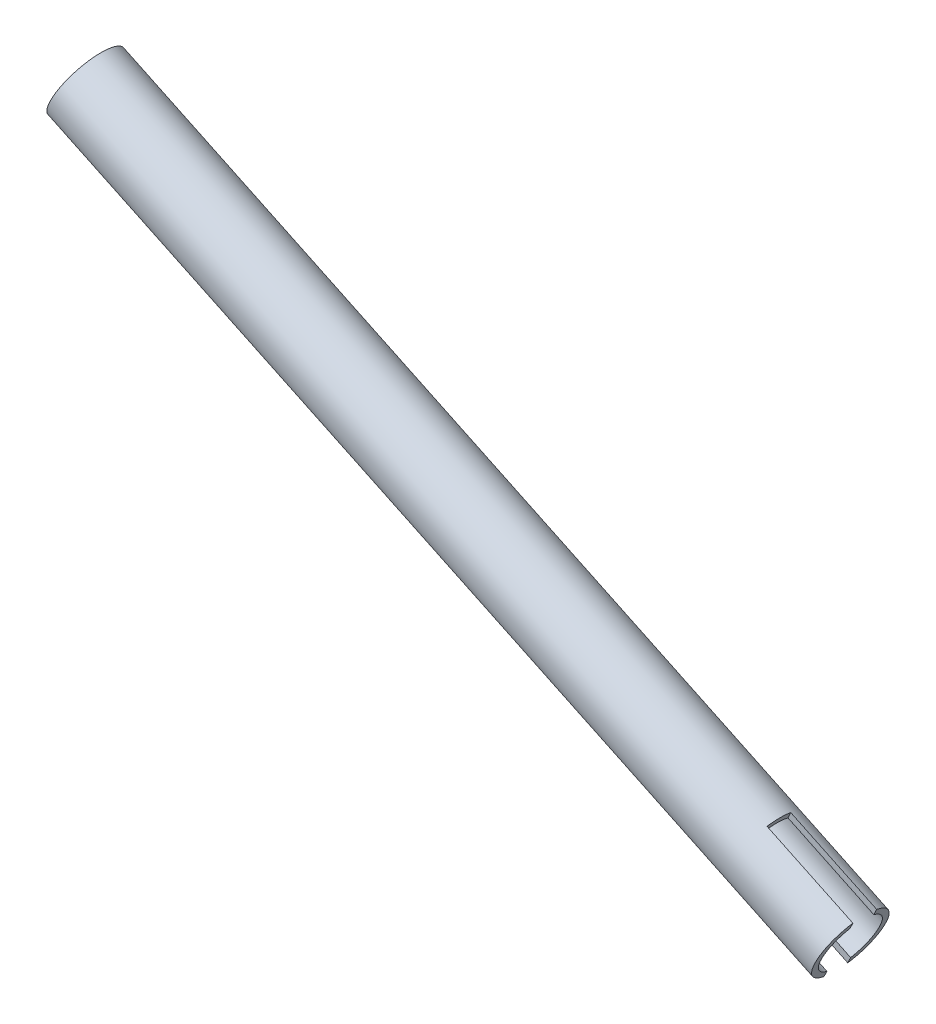
ISO-10303-21;
HEADER;
FILE_DESCRIPTION(('STEP AP214'),'2;1');
FILE_NAME('part.step','',(''),(''),'','','');
FILE_SCHEMA(('AUTOMOTIVE_DESIGN { 1 0 10303 214 1 1 1 1 }'));
ENDSEC;
DATA;
#1=APPLICATION_CONTEXT('core data for automotive mechanical design processes');
#2=APPLICATION_PROTOCOL_DEFINITION('international standard','automotive_design',2000,#1);
#3=PRODUCT_CONTEXT('',#1,'mechanical');
#4=PRODUCT('Part','Part','',(#3));
#5=PRODUCT_RELATED_PRODUCT_CATEGORY('part','',(#4));
#6=PRODUCT_DEFINITION_FORMATION('','',#4);
#7=PRODUCT_DEFINITION_CONTEXT('part definition',#1,'design');
#8=PRODUCT_DEFINITION('design','',#6,#7);
#9=PRODUCT_DEFINITION_SHAPE('','',#8);
#10=(LENGTH_UNIT() NAMED_UNIT(*) SI_UNIT(.MILLI.,.METRE.));
#11=(NAMED_UNIT(*) PLANE_ANGLE_UNIT() SI_UNIT($,.RADIAN.));
#12=(NAMED_UNIT(*) SI_UNIT($,.STERADIAN.) SOLID_ANGLE_UNIT());
#13=UNCERTAINTY_MEASURE_WITH_UNIT(LENGTH_MEASURE(1.E-05),#10,'distance_accuracy_value','');
#14=(GEOMETRIC_REPRESENTATION_CONTEXT(3) GLOBAL_UNCERTAINTY_ASSIGNED_CONTEXT((#13)) GLOBAL_UNIT_ASSIGNED_CONTEXT((#10,
#11,#12)) REPRESENTATION_CONTEXT('',''));
#15=CARTESIAN_POINT('',(0.,0.,0.));
#16=DIRECTION('',(0.,0.,1.));
#17=DIRECTION('',(1.,0.,0.));
#18=AXIS2_PLACEMENT_3D('',#15,#16,#17);
#19=CARTESIAN_POINT('',(520.64629590726,-1547.88206212744,0.));
#20=DIRECTION('',(0.902860928894006,-0.42993271924413,0.));
#21=DIRECTION('',(0.42993271924413,0.902860928894006,0.));
#22=AXIS2_PLACEMENT_3D('',#19,#20,#21);
#23=PLANE('',#22);
#24=DIRECTION('',(-0.429932719244135,-0.902860928894004,0.));
#25=VECTOR('',#24,1.);
#26=CARTESIAN_POINT('',(528.126695289389,-1532.17318482562,3.175));
#27=LINE('',#26,#25);
#28=CARTESIAN_POINT('',(527.892492072229,-1532.66501279016,3.175));
#29=VERTEX_POINT('',#28);
#30=CARTESIAN_POINT('',(527.12946696615,-1534.26736945018,3.175));
#31=VERTEX_POINT('',#30);
#32=EDGE_CURVE('E163',#29,#31,#27,.T.);
#33=ORIENTED_EDGE('',*,*,#32,.F.);
#34=CARTESIAN_POINT('',(524.031586138588,-1540.77293517333,0.));
#35=DIRECTION('',(-0.902860928894006,0.42993271924413,0.));
#36=DIRECTION('',(-0.42993271924413,-0.902860928894006,0.));
#37=AXIS2_PLACEMENT_3D('',#34,#35,#36);
#38=CIRCLE('',#37,9.52499999999987);
#39=CARTESIAN_POINT('',(520.170680204949,-1548.88085755651,3.175));
#40=VERTEX_POINT('',#39);
#41=EDGE_CURVE('E137',#40,#29,#38,.T.);
#42=ORIENTED_EDGE('',*,*,#41,.F.);
#43=CARTESIAN_POINT('',(520.933705311027,-1547.27850089648,3.175));
#44=VERTEX_POINT('',#43);
#45=EDGE_CURVE('E162',#44,#40,#27,.T.);
#46=ORIENTED_EDGE('',*,*,#45,.F.);
#47=CARTESIAN_POINT('',(524.031586138588,-1540.77293517333,0.));
#48=DIRECTION('',(-0.902860928894006,0.42993271924413,0.));
#49=DIRECTION('',(-0.42993271924413,-0.902860928894006,0.));
#50=AXIS2_PLACEMENT_3D('',#47,#48,#49);
#51=CIRCLE('',#50,7.87399999999977);
#52=EDGE_CURVE('E120',#44,#31,#51,.T.);
#53=ORIENTED_EDGE('',*,*,#52,.T.);
#54=EDGE_LOOP('',(#33,#42,#46,#53));
#55=FACE_BOUND('',#54,.T.);
#56=ADVANCED_FACE('F34',(#55),#23,.T.);
#57=CARTESIAN_POINT('',(319.879854925595,-1443.5580639458,0.));
#58=DIRECTION('',(-0.902860928894006,0.42993271924413,0.));
#59=DIRECTION('',(-0.42993271924413,-0.902860928894006,0.));
#60=AXIS2_PLACEMENT_3D('',#57,#58,#59);
#61=CYLINDRICAL_SURFACE('',#60,7.87399999999997);
#62=DIRECTION('',(-0.902860928894006,0.42993271924413,0.));
#63=VECTOR('',#62,1.);
#64=CARTESIAN_POINT('',(316.781974098033,-1450.06362966895,3.175));
#65=LINE('',#64,#63);
#66=CARTESIAN_POINT('',(498.001037717118,-1536.35820982768,3.175));
#67=VERTEX_POINT('',#66);
#68=EDGE_CURVE('E110',#67,#44,#65,.F.);
#69=ORIENTED_EDGE('',*,*,#68,.F.);
#70=CARTESIAN_POINT('',(501.09891854468,-1529.85264410453,0.));
#71=DIRECTION('',(0.902860928894009,-0.429932719244124,0.));
#72=DIRECTION('',(0.429932719244124,0.902860928894009,0.));
#73=AXIS2_PLACEMENT_3D('',#70,#71,#72);
#74=CIRCLE('',#73,7.87399999999997);
#75=CARTESIAN_POINT('',(498.001037717118,-1536.35820982768,-3.175));
#76=VERTEX_POINT('',#75);
#77=EDGE_CURVE('E98',#67,#76,#74,.T.);
#78=ORIENTED_EDGE('',*,*,#77,.T.);
#79=DIRECTION('',(-0.902860928894006,0.42993271924413,0.));
#80=VECTOR('',#79,1.);
#81=CARTESIAN_POINT('',(316.781974098033,-1450.06362966895,-3.175));
#82=LINE('',#81,#80);
#83=CARTESIAN_POINT('',(520.933705311027,-1547.27850089648,-3.175));
#84=VERTEX_POINT('',#83);
#85=EDGE_CURVE('E122',#84,#76,#82,.T.);
#86=ORIENTED_EDGE('',*,*,#85,.F.);
#87=CARTESIAN_POINT('',(527.12946696615,-1534.26736945018,-3.175));
#88=VERTEX_POINT('',#87);
#89=EDGE_CURVE('E140',#88,#84,#51,.T.);
#90=ORIENTED_EDGE('',*,*,#89,.F.);
#91=DIRECTION('',(-0.902860928894006,0.42993271924413,0.));
#92=VECTOR('',#91,1.);
#93=CARTESIAN_POINT('',(322.977735753157,-1437.05249822265,-3.175));
#94=LINE('',#93,#92);
#95=CARTESIAN_POINT('',(504.196799372241,-1523.34707838138,-3.175));
#96=VERTEX_POINT('',#95);
#97=EDGE_CURVE('E105',#96,#88,#94,.F.);
#98=ORIENTED_EDGE('',*,*,#97,.F.);
#99=CARTESIAN_POINT('',(504.196799372241,-1523.34707838138,3.175));
#100=VERTEX_POINT('',#99);
#101=EDGE_CURVE('E106',#96,#100,#74,.T.);
#102=ORIENTED_EDGE('',*,*,#101,.T.);
#103=DIRECTION('',(-0.902860928894006,0.42993271924413,0.));
#104=VECTOR('',#103,1.);
#105=CARTESIAN_POINT('',(322.977735753157,-1437.05249822265,3.175));
#106=LINE('',#105,#104);
#107=EDGE_CURVE('E121',#31,#100,#106,.T.);
#108=ORIENTED_EDGE('',*,*,#107,.F.);
#109=ORIENTED_EDGE('',*,*,#52,.F.);
#110=EDGE_LOOP('',(#69,#78,#86,#90,#98,#102,#108,#109));
#111=FACE_BOUND('',#110,.T.);
#112=CARTESIAN_POINT('',(319.879854925595,-1443.5580639458,0.));
#113=DIRECTION('',(-0.902860928894006,0.42993271924413,0.));
#114=DIRECTION('',(-0.42993271924413,-0.902860928894006,0.));
#115=AXIS2_PLACEMENT_3D('',#112,#113,#114);
#116=CIRCLE('',#115,7.87400000000006);
#117=CARTESIAN_POINT('',(316.494564694267,-1450.66719089991,0.));
#118=VERTEX_POINT('',#117);
#119=EDGE_CURVE('E124',#118,#118,#116,.T.);
#120=ORIENTED_EDGE('',*,*,#119,.T.);
#121=EDGE_LOOP('',(#120));
#122=FACE_BOUND('',#121,.T.);
#123=ADVANCED_FACE('F36',(#111,#122),#61,.F.);
#124=DIRECTION('',(0.429932719244135,0.902860928894004,0.));
#125=VECTOR('',#124,1.);
#126=CARTESIAN_POINT('',(528.126695289389,-1532.17318482562,-3.175));
#127=LINE('',#126,#125);
#128=CARTESIAN_POINT('',(520.170680204949,-1548.88085755651,-3.175));
#129=VERTEX_POINT('',#128);
#130=EDGE_CURVE('E156',#129,#84,#127,.T.);
#131=ORIENTED_EDGE('',*,*,#130,.F.);
#132=CARTESIAN_POINT('',(527.892492072229,-1532.66501279016,-3.175));
#133=VERTEX_POINT('',#132);
#134=EDGE_CURVE('E134',#133,#129,#38,.T.);
#135=ORIENTED_EDGE('',*,*,#134,.F.);
#136=EDGE_CURVE('E56',#88,#133,#127,.T.);
#137=ORIENTED_EDGE('',*,*,#136,.F.);
#138=ORIENTED_EDGE('',*,*,#89,.T.);
#139=EDGE_LOOP('',(#131,#135,#137,#138));
#140=FACE_BOUND('',#139,.T.);
#141=ADVANCED_FACE('F172',(#140),#23,.T.);
#142=CARTESIAN_POINT('',(319.879854925595,-1443.5580639458,0.));
#143=DIRECTION('',(-0.902860928894006,0.42993271924413,0.));
#144=DIRECTION('',(-0.42993271924413,-0.902860928894006,0.));
#145=AXIS2_PLACEMENT_3D('',#142,#143,#144);
#146=CYLINDRICAL_SURFACE('',#145,9.52500000000004);
#147=DIRECTION('',(-0.902860928894006,0.42993271924413,0.));
#148=VECTOR('',#147,1.);
#149=CARTESIAN_POINT('',(316.018948991955,-1451.66598632898,3.175));
#150=LINE('',#149,#148);
#151=CARTESIAN_POINT('',(497.23801261104,-1537.9605664877,3.175));
#152=VERTEX_POINT('',#151);
#153=EDGE_CURVE('E11',#40,#152,#150,.T.);
#154=ORIENTED_EDGE('',*,*,#153,.F.);
#155=ORIENTED_EDGE('',*,*,#41,.T.);
#156=DIRECTION('',(-0.902860928894006,0.42993271924413,0.));
#157=VECTOR('',#156,1.);
#158=CARTESIAN_POINT('',(323.740760859235,-1435.45014156263,3.175));
#159=LINE('',#158,#157);
#160=CARTESIAN_POINT('',(504.95982447832,-1521.74472172136,3.175));
#161=VERTEX_POINT('',#160);
#162=EDGE_CURVE('E145',#161,#29,#159,.F.);
#163=ORIENTED_EDGE('',*,*,#162,.F.);
#164=CARTESIAN_POINT('',(501.09891854468,-1529.85264410453,0.));
#165=DIRECTION('',(0.902860928894009,-0.429932719244124,0.));
#166=DIRECTION('',(0.429932719244124,0.902860928894009,0.));
#167=AXIS2_PLACEMENT_3D('',#164,#165,#166);
#168=CIRCLE('',#167,9.52500000000004);
#169=CARTESIAN_POINT('',(504.95982447832,-1521.74472172136,-3.175));
#170=VERTEX_POINT('',#169);
#171=EDGE_CURVE('E139',#161,#170,#168,.F.);
#172=ORIENTED_EDGE('',*,*,#171,.T.);
#173=DIRECTION('',(-0.902860928894006,0.42993271924413,0.));
#174=VECTOR('',#173,1.);
#175=CARTESIAN_POINT('',(323.740760859235,-1435.45014156263,-3.175));
#176=LINE('',#175,#174);
#177=EDGE_CURVE('E142',#133,#170,#176,.T.);
#178=ORIENTED_EDGE('',*,*,#177,.F.);
#179=ORIENTED_EDGE('',*,*,#134,.T.);
#180=DIRECTION('',(-0.902860928894006,0.42993271924413,0.));
#181=VECTOR('',#180,1.);
#182=CARTESIAN_POINT('',(316.018948991955,-1451.66598632898,-3.175));
#183=LINE('',#182,#181);
#184=CARTESIAN_POINT('',(497.23801261104,-1537.9605664877,-3.175));
#185=VERTEX_POINT('',#184);
#186=EDGE_CURVE('E42',#185,#129,#183,.F.);
#187=ORIENTED_EDGE('',*,*,#186,.F.);
#188=EDGE_CURVE('E143',#185,#152,#168,.F.);
#189=ORIENTED_EDGE('',*,*,#188,.T.);
#190=EDGE_LOOP('',(#154,#155,#163,#172,#178,#179,#187,#189));
#191=FACE_BOUND('',#190,.T.);
#192=CARTESIAN_POINT('',(319.879854925595,-1443.5580639458,0.));
#193=DIRECTION('',(-0.902860928894006,0.42993271924413,0.));
#194=DIRECTION('',(-0.42993271924413,-0.902860928894006,0.));
#195=AXIS2_PLACEMENT_3D('',#192,#193,#194);
#196=CIRCLE('',#195,9.52500000000015);
#197=CARTESIAN_POINT('',(315.784745774794,-1452.15781429352,0.));
#198=VERTEX_POINT('',#197);
#199=EDGE_CURVE('E131',#198,#198,#196,.T.);
#200=ORIENTED_EDGE('',*,*,#199,.F.);
#201=EDGE_LOOP('',(#200));
#202=FACE_BOUND('',#201,.T.);
#203=ADVANCED_FACE('F150',(#191,#202),#146,.T.);
#204=CARTESIAN_POINT('',(315.784745774794,-1452.15781429352,0.));
#205=DIRECTION('',(-0.902860928894006,0.42993271924413,0.));
#206=DIRECTION('',(-0.42993271924413,-0.902860928894006,0.));
#207=AXIS2_PLACEMENT_3D('',#204,#205,#206);
#208=PLANE('',#207);
#209=ORIENTED_EDGE('',*,*,#199,.T.);
#210=EDGE_LOOP('',(#209));
#211=FACE_BOUND('',#210,.T.);
#212=ORIENTED_EDGE('',*,*,#119,.F.);
#213=EDGE_LOOP('',(#212));
#214=FACE_BOUND('',#213,.T.);
#215=ADVANCED_FACE('F182',(#211,#214),#208,.T.);
#216=CARTESIAN_POINT('',(1002.31678650574,-477.292535068858,3.175));
#217=DIRECTION('',(0.902860928894009,-0.429932719244124,0.));
#218=DIRECTION('',(0.429932719244124,0.902860928894009,0.));
#219=AXIS2_PLACEMENT_3D('',#216,#217,#218);
#220=PLANE('',#219);
#221=DIRECTION('',(-0.429932719244124,-0.902860928894009,0.));
#222=VECTOR('',#221,1.);
#223=CARTESIAN_POINT('',(505.19402769548,-1521.25289375682,-3.175));
#224=LINE('',#223,#222);
#225=EDGE_CURVE('E155',#170,#96,#224,.T.);
#226=ORIENTED_EDGE('',*,*,#225,.F.);
#227=ORIENTED_EDGE('',*,*,#171,.F.);
#228=DIRECTION('',(0.429932719244124,0.902860928894009,0.));
#229=VECTOR('',#228,1.);
#230=CARTESIAN_POINT('',(505.19402769548,-1521.25289375682,3.175));
#231=LINE('',#230,#229);
#232=EDGE_CURVE('E114',#100,#161,#231,.T.);
#233=ORIENTED_EDGE('',*,*,#232,.F.);
#234=ORIENTED_EDGE('',*,*,#101,.F.);
#235=EDGE_LOOP('',(#226,#227,#233,#234));
#236=FACE_BOUND('',#235,.T.);
#237=ADVANCED_FACE('F180',(#236),#220,.T.);
#238=CARTESIAN_POINT('',(487.06416209041,-1512.61964563446,-3.175));
#239=DIRECTION('',(0.,0.,-1.));
#240=DIRECTION('',(0.,1.,0.));
#241=AXIS2_PLACEMENT_3D('',#238,#239,#240);
#242=PLANE('',#241);
#243=ORIENTED_EDGE('',*,*,#97,.T.);
#244=ORIENTED_EDGE('',*,*,#136,.T.);
#245=ORIENTED_EDGE('',*,*,#177,.T.);
#246=ORIENTED_EDGE('',*,*,#225,.T.);
#247=EDGE_LOOP('',(#243,#244,#245,#246));
#248=FACE_BOUND('',#247,.T.);
#249=ADVANCED_FACE('F166',(#248),#242,.F.);
#250=CARTESIAN_POINT('',(487.06416209041,-1512.61964563446,3.175));
#251=DIRECTION('',(0.,0.,1.));
#252=DIRECTION('',(0.,-1.,0.));
#253=AXIS2_PLACEMENT_3D('',#250,#251,#252);
#254=PLANE('',#253);
#255=ORIENTED_EDGE('',*,*,#107,.T.);
#256=ORIENTED_EDGE('',*,*,#232,.T.);
#257=ORIENTED_EDGE('',*,*,#162,.T.);
#258=ORIENTED_EDGE('',*,*,#32,.T.);
#259=EDGE_LOOP('',(#255,#256,#257,#258));
#260=FACE_BOUND('',#259,.T.);
#261=ADVANCED_FACE('F177',(#260),#254,.F.);
#262=ORIENTED_EDGE('',*,*,#85,.T.);
#263=EDGE_CURVE('E101',#76,#185,#224,.T.);
#264=ORIENTED_EDGE('',*,*,#263,.T.);
#265=ORIENTED_EDGE('',*,*,#186,.T.);
#266=ORIENTED_EDGE('',*,*,#130,.T.);
#267=EDGE_LOOP('',(#262,#264,#265,#266));
#268=FACE_BOUND('',#267,.T.);
#269=ADVANCED_FACE('F154',(#268),#242,.F.);
#270=EDGE_CURVE('E49',#152,#67,#231,.T.);
#271=ORIENTED_EDGE('',*,*,#270,.F.);
#272=ORIENTED_EDGE('',*,*,#188,.F.);
#273=ORIENTED_EDGE('',*,*,#263,.F.);
#274=ORIENTED_EDGE('',*,*,#77,.F.);
#275=EDGE_LOOP('',(#271,#272,#273,#274));
#276=FACE_BOUND('',#275,.T.);
#277=ADVANCED_FACE('F99',(#276),#220,.T.);
#278=ORIENTED_EDGE('',*,*,#68,.T.);
#279=ORIENTED_EDGE('',*,*,#45,.T.);
#280=ORIENTED_EDGE('',*,*,#153,.T.);
#281=ORIENTED_EDGE('',*,*,#270,.T.);
#282=EDGE_LOOP('',(#278,#279,#280,#281));
#283=FACE_BOUND('',#282,.T.);
#284=ADVANCED_FACE('F109',(#283),#254,.F.);
#285=CLOSED_SHELL('',(#56,#123,#141,#203,#215,#237,#249,#261,#269,#277,#284));
#286=MANIFOLD_SOLID_BREP('B2',#285);
#287=ADVANCED_BREP_SHAPE_REPRESENTATION('',(#18,#286),#14);
#288=SHAPE_DEFINITION_REPRESENTATION(#9,#287);
ENDSEC;
END-ISO-10303-21;
